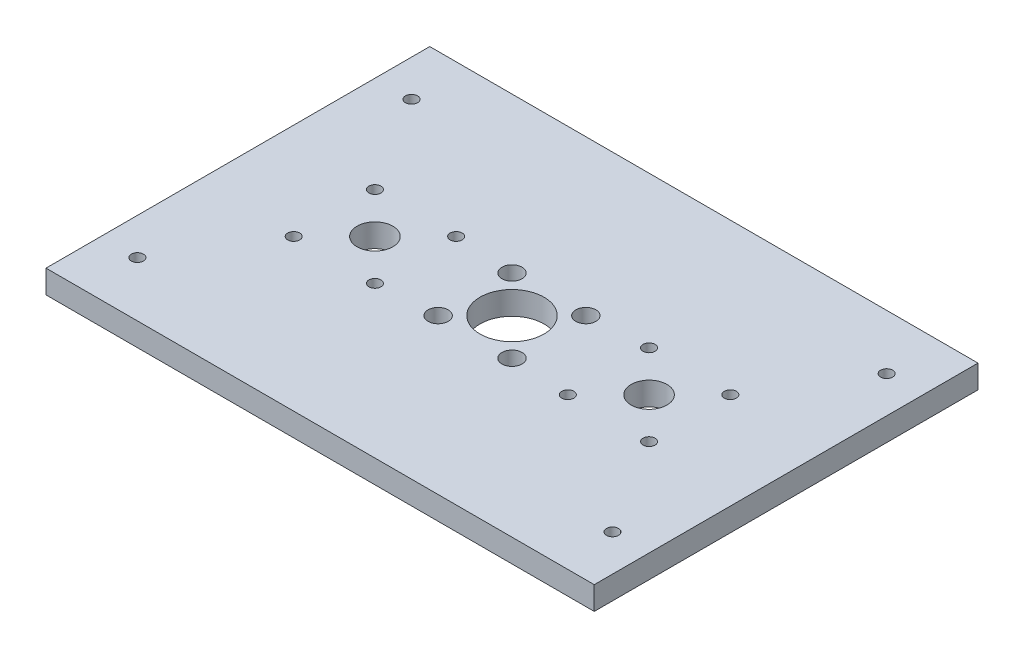
ISO-10303-21;
HEADER;
FILE_DESCRIPTION(('STEP AP214'),'2;1');
FILE_NAME('part.step','',(''),(''),'','','');
FILE_SCHEMA(('AUTOMOTIVE_DESIGN { 1 0 10303 214 1 1 1 1 }'));
ENDSEC;
DATA;
#1=APPLICATION_CONTEXT('core data for automotive mechanical design processes');
#2=APPLICATION_PROTOCOL_DEFINITION('international standard','automotive_design',2000,#1);
#3=PRODUCT_CONTEXT('',#1,'mechanical');
#4=PRODUCT('Part','Part','',(#3));
#5=PRODUCT_RELATED_PRODUCT_CATEGORY('part','',(#4));
#6=PRODUCT_DEFINITION_FORMATION('','',#4);
#7=PRODUCT_DEFINITION_CONTEXT('part definition',#1,'design');
#8=PRODUCT_DEFINITION('design','',#6,#7);
#9=PRODUCT_DEFINITION_SHAPE('','',#8);
#10=(LENGTH_UNIT() NAMED_UNIT(*) SI_UNIT(.MILLI.,.METRE.));
#11=(NAMED_UNIT(*) PLANE_ANGLE_UNIT() SI_UNIT($,.RADIAN.));
#12=(NAMED_UNIT(*) SI_UNIT($,.STERADIAN.) SOLID_ANGLE_UNIT());
#13=UNCERTAINTY_MEASURE_WITH_UNIT(LENGTH_MEASURE(1.E-05),#10,'distance_accuracy_value','');
#14=(GEOMETRIC_REPRESENTATION_CONTEXT(3) GLOBAL_UNCERTAINTY_ASSIGNED_CONTEXT((#13)) GLOBAL_UNIT_ASSIGNED_CONTEXT((#10,
#11,#12)) REPRESENTATION_CONTEXT('',''));
#15=CARTESIAN_POINT('',(0.,0.,0.));
#16=DIRECTION('',(0.,0.,1.));
#17=DIRECTION('',(1.,0.,0.));
#18=AXIS2_PLACEMENT_3D('',#15,#16,#17);
#19=CARTESIAN_POINT('',(0.,6.35,0.));
#20=DIRECTION('',(0.,-1.,0.));
#21=DIRECTION('',(0.,0.,-1.));
#22=AXIS2_PLACEMENT_3D('',#19,#20,#21);
#23=PLANE('',#22);
#24=CARTESIAN_POINT('',(65.,6.35,-37.5));
#25=DIRECTION('',(0.,1.,0.));
#26=DIRECTION('',(0.,0.,-1.));
#27=AXIS2_PLACEMENT_3D('',#24,#25,#26);
#28=CIRCLE('',#27,1.65);
#29=CARTESIAN_POINT('',(65.,6.35,-39.15));
#30=VERTEX_POINT('',#29);
#31=EDGE_CURVE('E217',#30,#30,#28,.T.);
#32=ORIENTED_EDGE('',*,*,#31,.F.);
#33=EDGE_LOOP('',(#32));
#34=FACE_BOUND('',#33,.T.);
#35=CARTESIAN_POINT('',(65.,6.35,37.5));
#36=DIRECTION('',(0.,1.,0.));
#37=DIRECTION('',(0.,0.,-1.));
#38=AXIS2_PLACEMENT_3D('',#35,#36,#37);
#39=CIRCLE('',#38,1.65);
#40=CARTESIAN_POINT('',(65.,6.35,35.85));
#41=VERTEX_POINT('',#40);
#42=EDGE_CURVE('E223',#41,#41,#39,.T.);
#43=ORIENTED_EDGE('',*,*,#42,.F.);
#44=EDGE_LOOP('',(#43));
#45=FACE_BOUND('',#44,.T.);
#46=CARTESIAN_POINT('',(-65.,6.35,37.5));
#47=DIRECTION('',(0.,1.,0.));
#48=DIRECTION('',(0.,0.,1.));
#49=AXIS2_PLACEMENT_3D('',#46,#47,#48);
#50=CIRCLE('',#49,1.65);
#51=CARTESIAN_POINT('',(-65.,6.35,39.15));
#52=VERTEX_POINT('',#51);
#53=EDGE_CURVE('E211',#52,#52,#50,.T.);
#54=ORIENTED_EDGE('',*,*,#53,.F.);
#55=EDGE_LOOP('',(#54));
#56=FACE_BOUND('',#55,.T.);
#57=CARTESIAN_POINT('',(-65.,6.35,-37.5));
#58=DIRECTION('',(0.,1.,0.));
#59=DIRECTION('',(0.,0.,1.));
#60=AXIS2_PLACEMENT_3D('',#57,#58,#59);
#61=CIRCLE('',#60,1.65);
#62=CARTESIAN_POINT('',(-65.,6.35,-35.85));
#63=VERTEX_POINT('',#62);
#64=EDGE_CURVE('E208',#63,#63,#61,.T.);
#65=ORIENTED_EDGE('',*,*,#64,.F.);
#66=EDGE_LOOP('',(#65));
#67=FACE_BOUND('',#66,.T.);
#68=CARTESIAN_POINT('',(37.5000000000002,6.35,0.));
#69=DIRECTION('',(0.,1.,0.));
#70=DIRECTION('',(0.,0.,1.));
#71=AXIS2_PLACEMENT_3D('',#68,#69,#70);
#72=CIRCLE('',#71,4.9);
#73=CARTESIAN_POINT('',(37.5000000000002,6.35,4.89999999999999));
#74=VERTEX_POINT('',#73);
#75=EDGE_CURVE('E151',#74,#74,#72,.T.);
#76=ORIENTED_EDGE('',*,*,#75,.F.);
#77=EDGE_LOOP('',(#76));
#78=FACE_BOUND('',#77,.T.);
#79=CARTESIAN_POINT('',(48.6125000000002,6.35,11.1125));
#80=DIRECTION('',(0.,1.,0.));
#81=DIRECTION('',(0.,0.,1.));
#82=AXIS2_PLACEMENT_3D('',#79,#80,#81);
#83=CIRCLE('',#82,1.65);
#84=CARTESIAN_POINT('',(48.6125000000002,6.35,12.7625));
#85=VERTEX_POINT('',#84);
#86=EDGE_CURVE('E194',#85,#85,#83,.T.);
#87=ORIENTED_EDGE('',*,*,#86,.F.);
#88=EDGE_LOOP('',(#87));
#89=FACE_BOUND('',#88,.T.);
#90=CARTESIAN_POINT('',(26.3875000000002,6.35,11.1125));
#91=DIRECTION('',(0.,1.,0.));
#92=DIRECTION('',(0.,0.,1.));
#93=AXIS2_PLACEMENT_3D('',#90,#91,#92);
#94=CIRCLE('',#93,1.65);
#95=CARTESIAN_POINT('',(26.3875000000002,6.35,12.7625));
#96=VERTEX_POINT('',#95);
#97=EDGE_CURVE('E188',#96,#96,#94,.T.);
#98=ORIENTED_EDGE('',*,*,#97,.F.);
#99=EDGE_LOOP('',(#98));
#100=FACE_BOUND('',#99,.T.);
#101=CARTESIAN_POINT('',(26.3875000000002,6.35,-11.1125));
#102=DIRECTION('',(0.,1.,0.));
#103=DIRECTION('',(0.,0.,1.));
#104=AXIS2_PLACEMENT_3D('',#101,#102,#103);
#105=CIRCLE('',#104,1.65);
#106=CARTESIAN_POINT('',(26.3875000000002,6.35,-9.46250000000001));
#107=VERTEX_POINT('',#106);
#108=EDGE_CURVE('E182',#107,#107,#105,.T.);
#109=ORIENTED_EDGE('',*,*,#108,.F.);
#110=EDGE_LOOP('',(#109));
#111=FACE_BOUND('',#110,.T.);
#112=CARTESIAN_POINT('',(-26.3875000000002,6.35,11.1125));
#113=DIRECTION('',(0.,1.,0.));
#114=DIRECTION('',(0.,0.,-1.));
#115=AXIS2_PLACEMENT_3D('',#112,#113,#114);
#116=CIRCLE('',#115,1.65);
#117=CARTESIAN_POINT('',(-26.3875000000002,6.35,9.4625));
#118=VERTEX_POINT('',#117);
#119=EDGE_CURVE('E176',#118,#118,#116,.T.);
#120=ORIENTED_EDGE('',*,*,#119,.F.);
#121=EDGE_LOOP('',(#120));
#122=FACE_BOUND('',#121,.T.);
#123=CARTESIAN_POINT('',(-48.6125000000002,6.35,11.1125));
#124=DIRECTION('',(0.,1.,0.));
#125=DIRECTION('',(0.,0.,-1.));
#126=AXIS2_PLACEMENT_3D('',#123,#124,#125);
#127=CIRCLE('',#126,1.65);
#128=CARTESIAN_POINT('',(-48.6125000000002,6.35,9.46250000000001));
#129=VERTEX_POINT('',#128);
#130=EDGE_CURVE('E170',#129,#129,#127,.T.);
#131=ORIENTED_EDGE('',*,*,#130,.F.);
#132=EDGE_LOOP('',(#131));
#133=FACE_BOUND('',#132,.T.);
#134=CARTESIAN_POINT('',(-48.6125000000002,6.35,-11.1125));
#135=DIRECTION('',(0.,1.,0.));
#136=DIRECTION('',(0.,0.,-1.));
#137=AXIS2_PLACEMENT_3D('',#134,#135,#136);
#138=CIRCLE('',#137,1.65);
#139=CARTESIAN_POINT('',(-48.6125000000002,6.35,-12.7625));
#140=VERTEX_POINT('',#139);
#141=EDGE_CURVE('E164',#140,#140,#138,.T.);
#142=ORIENTED_EDGE('',*,*,#141,.F.);
#143=EDGE_LOOP('',(#142));
#144=FACE_BOUND('',#143,.T.);
#145=CARTESIAN_POINT('',(-26.3875000000002,6.35,-11.1125));
#146=DIRECTION('',(0.,1.,0.));
#147=DIRECTION('',(0.,0.,-1.));
#148=AXIS2_PLACEMENT_3D('',#145,#146,#147);
#149=CIRCLE('',#148,1.65);
#150=CARTESIAN_POINT('',(-26.3875000000002,6.35,-12.7625));
#151=VERTEX_POINT('',#150);
#152=EDGE_CURVE('E157',#151,#151,#149,.T.);
#153=ORIENTED_EDGE('',*,*,#152,.F.);
#154=EDGE_LOOP('',(#153));
#155=FACE_BOUND('',#154,.T.);
#156=CARTESIAN_POINT('',(-37.4999999999998,6.35,0.));
#157=DIRECTION('',(0.,1.,0.));
#158=DIRECTION('',(0.,0.,-1.));
#159=AXIS2_PLACEMENT_3D('',#156,#157,#158);
#160=CIRCLE('',#159,4.9);
#161=CARTESIAN_POINT('',(-37.4999999999998,6.35,-4.89999999999999));
#162=VERTEX_POINT('',#161);
#163=EDGE_CURVE('E158',#162,#162,#160,.T.);
#164=ORIENTED_EDGE('',*,*,#163,.F.);
#165=EDGE_LOOP('',(#164));
#166=FACE_BOUND('',#165,.T.);
#167=CARTESIAN_POINT('',(48.6125000000002,6.35,-11.1125));
#168=DIRECTION('',(0.,1.,0.));
#169=DIRECTION('',(0.,0.,1.));
#170=AXIS2_PLACEMENT_3D('',#167,#168,#169);
#171=CIRCLE('',#170,1.65);
#172=CARTESIAN_POINT('',(48.6125000000002,6.35,-9.4625));
#173=VERTEX_POINT('',#172);
#174=EDGE_CURVE('E148',#173,#173,#171,.T.);
#175=ORIENTED_EDGE('',*,*,#174,.F.);
#176=EDGE_LOOP('',(#175));
#177=FACE_BOUND('',#176,.T.);
#178=DIRECTION('',(0.,0.,1.));
#179=VECTOR('',#178,1.);
#180=CARTESIAN_POINT('',(-75.,6.35,-52.5));
#181=LINE('',#180,#179);
#182=CARTESIAN_POINT('',(-75.,6.35,-52.5));
#183=VERTEX_POINT('',#182);
#184=CARTESIAN_POINT('',(-75.,6.35,52.5));
#185=VERTEX_POINT('',#184);
#186=EDGE_CURVE('E91',#183,#185,#181,.T.);
#187=ORIENTED_EDGE('',*,*,#186,.T.);
#188=DIRECTION('',(1.,0.,0.));
#189=VECTOR('',#188,1.);
#190=CARTESIAN_POINT('',(75.,6.35,52.5));
#191=LINE('',#190,#189);
#192=CARTESIAN_POINT('',(75.,6.35,52.5));
#193=VERTEX_POINT('',#192);
#194=EDGE_CURVE('E86',#185,#193,#191,.T.);
#195=ORIENTED_EDGE('',*,*,#194,.T.);
#196=DIRECTION('',(0.,0.,-1.));
#197=VECTOR('',#196,1.);
#198=CARTESIAN_POINT('',(75.,6.35,-52.5));
#199=LINE('',#198,#197);
#200=CARTESIAN_POINT('',(75.,6.35,-52.5));
#201=VERTEX_POINT('',#200);
#202=EDGE_CURVE('E89',#193,#201,#199,.T.);
#203=ORIENTED_EDGE('',*,*,#202,.T.);
#204=DIRECTION('',(-1.,0.,0.));
#205=VECTOR('',#204,1.);
#206=CARTESIAN_POINT('',(75.,6.35,-52.5));
#207=LINE('',#206,#205);
#208=EDGE_CURVE('E56',#201,#183,#207,.T.);
#209=ORIENTED_EDGE('',*,*,#208,.T.);
#210=EDGE_LOOP('',(#187,#195,#203,#209));
#211=FACE_BOUND('',#210,.T.);
#212=CARTESIAN_POINT('',(4.44089209850063E-13,6.35,4.44089209850063E-13));
#213=DIRECTION('',(0.,1.,0.));
#214=DIRECTION('',(0.,0.,1.));
#215=AXIS2_PLACEMENT_3D('',#212,#213,#214);
#216=CIRCLE('',#215,8.75000000000001);
#217=CARTESIAN_POINT('',(4.44089209850063E-13,6.35,8.75000000000045));
#218=VERTEX_POINT('',#217);
#219=EDGE_CURVE('E106',#218,#218,#216,.T.);
#220=ORIENTED_EDGE('',*,*,#219,.F.);
#221=EDGE_LOOP('',(#220));
#222=FACE_BOUND('',#221,.T.);
#223=CARTESIAN_POINT('',(10.1027881362028,6.35,10.1027881362028));
#224=DIRECTION('',(0.,1.,0.));
#225=DIRECTION('',(0.,0.,1.));
#226=AXIS2_PLACEMENT_3D('',#223,#224,#225);
#227=CIRCLE('',#226,2.75);
#228=CARTESIAN_POINT('',(10.1027881362028,6.35,12.8527881362028));
#229=VERTEX_POINT('',#228);
#230=EDGE_CURVE('E121',#229,#229,#227,.T.);
#231=ORIENTED_EDGE('',*,*,#230,.F.);
#232=EDGE_LOOP('',(#231));
#233=FACE_BOUND('',#232,.T.);
#234=CARTESIAN_POINT('',(10.1027881362028,6.35,-10.1027881362028));
#235=DIRECTION('',(0.,1.,0.));
#236=DIRECTION('',(0.,0.,1.));
#237=AXIS2_PLACEMENT_3D('',#234,#235,#236);
#238=CIRCLE('',#237,2.75);
#239=CARTESIAN_POINT('',(10.1027881362028,6.35,-7.3527881362028));
#240=VERTEX_POINT('',#239);
#241=EDGE_CURVE('E127',#240,#240,#238,.T.);
#242=ORIENTED_EDGE('',*,*,#241,.F.);
#243=EDGE_LOOP('',(#242));
#244=FACE_BOUND('',#243,.T.);
#245=CARTESIAN_POINT('',(-10.1027881362028,6.35,10.1027881362028));
#246=DIRECTION('',(0.,1.,0.));
#247=DIRECTION('',(0.,0.,1.));
#248=AXIS2_PLACEMENT_3D('',#245,#246,#247);
#249=CIRCLE('',#248,2.75);
#250=CARTESIAN_POINT('',(-10.1027881362028,6.35,12.8527881362028));
#251=VERTEX_POINT('',#250);
#252=EDGE_CURVE('E133',#251,#251,#249,.T.);
#253=ORIENTED_EDGE('',*,*,#252,.F.);
#254=EDGE_LOOP('',(#253));
#255=FACE_BOUND('',#254,.T.);
#256=CARTESIAN_POINT('',(-10.1027881362028,6.35,-10.1027881362028));
#257=DIRECTION('',(0.,1.,0.));
#258=DIRECTION('',(0.,0.,1.));
#259=AXIS2_PLACEMENT_3D('',#256,#257,#258);
#260=CIRCLE('',#259,2.75);
#261=CARTESIAN_POINT('',(-10.1027881362028,6.35,-7.3527881362028));
#262=VERTEX_POINT('',#261);
#263=EDGE_CURVE('E139',#262,#262,#260,.T.);
#264=ORIENTED_EDGE('',*,*,#263,.F.);
#265=EDGE_LOOP('',(#264));
#266=FACE_BOUND('',#265,.T.);
#267=ADVANCED_FACE('F39',(#34,#45,#56,#67,#78,#89,#100,#111,#122,#133,#144,#155,#166,#177,#211,
#222,#233,#244,#255,#266),#23,.F.);
#268=CARTESIAN_POINT('',(0.,0.,0.));
#269=DIRECTION('',(0.,-1.,0.));
#270=DIRECTION('',(0.,0.,-1.));
#271=AXIS2_PLACEMENT_3D('',#268,#269,#270);
#272=PLANE('',#271);
#273=CARTESIAN_POINT('',(65.,0.,-37.5));
#274=DIRECTION('',(0.,1.,0.));
#275=DIRECTION('',(0.,0.,-1.));
#276=AXIS2_PLACEMENT_3D('',#273,#274,#275);
#277=CIRCLE('',#276,1.65);
#278=CARTESIAN_POINT('',(65.,0.,-39.15));
#279=VERTEX_POINT('',#278);
#280=EDGE_CURVE('E214',#279,#279,#277,.T.);
#281=ORIENTED_EDGE('',*,*,#280,.T.);
#282=EDGE_LOOP('',(#281));
#283=FACE_BOUND('',#282,.T.);
#284=CARTESIAN_POINT('',(65.,0.,37.5));
#285=DIRECTION('',(0.,1.,0.));
#286=DIRECTION('',(0.,0.,-1.));
#287=AXIS2_PLACEMENT_3D('',#284,#285,#286);
#288=CIRCLE('',#287,1.65);
#289=CARTESIAN_POINT('',(65.,0.,35.85));
#290=VERTEX_POINT('',#289);
#291=EDGE_CURVE('E220',#290,#290,#288,.T.);
#292=ORIENTED_EDGE('',*,*,#291,.T.);
#293=EDGE_LOOP('',(#292));
#294=FACE_BOUND('',#293,.T.);
#295=CARTESIAN_POINT('',(-65.,0.,37.5));
#296=DIRECTION('',(0.,1.,0.));
#297=DIRECTION('',(0.,0.,1.));
#298=AXIS2_PLACEMENT_3D('',#295,#296,#297);
#299=CIRCLE('',#298,1.65);
#300=CARTESIAN_POINT('',(-65.,0.,39.15));
#301=VERTEX_POINT('',#300);
#302=EDGE_CURVE('E226',#301,#301,#299,.T.);
#303=ORIENTED_EDGE('',*,*,#302,.T.);
#304=EDGE_LOOP('',(#303));
#305=FACE_BOUND('',#304,.T.);
#306=CARTESIAN_POINT('',(-65.,0.,-37.5));
#307=DIRECTION('',(0.,1.,0.));
#308=DIRECTION('',(0.,0.,1.));
#309=AXIS2_PLACEMENT_3D('',#306,#307,#308);
#310=CIRCLE('',#309,1.65);
#311=CARTESIAN_POINT('',(-65.,0.,-35.85));
#312=VERTEX_POINT('',#311);
#313=EDGE_CURVE('E205',#312,#312,#310,.T.);
#314=ORIENTED_EDGE('',*,*,#313,.T.);
#315=EDGE_LOOP('',(#314));
#316=FACE_BOUND('',#315,.T.);
#317=CARTESIAN_POINT('',(37.5000000000002,0.,0.));
#318=DIRECTION('',(0.,1.,0.));
#319=DIRECTION('',(0.,0.,1.));
#320=AXIS2_PLACEMENT_3D('',#317,#318,#319);
#321=CIRCLE('',#320,4.9);
#322=CARTESIAN_POINT('',(37.5000000000002,0.,4.89999999999999));
#323=VERTEX_POINT('',#322);
#324=EDGE_CURVE('E197',#323,#323,#321,.T.);
#325=ORIENTED_EDGE('',*,*,#324,.T.);
#326=EDGE_LOOP('',(#325));
#327=FACE_BOUND('',#326,.T.);
#328=CARTESIAN_POINT('',(48.6125000000002,0.,11.1125));
#329=DIRECTION('',(0.,1.,0.));
#330=DIRECTION('',(0.,0.,1.));
#331=AXIS2_PLACEMENT_3D('',#328,#329,#330);
#332=CIRCLE('',#331,1.65);
#333=CARTESIAN_POINT('',(48.6125000000002,0.,12.7625));
#334=VERTEX_POINT('',#333);
#335=EDGE_CURVE('E191',#334,#334,#332,.T.);
#336=ORIENTED_EDGE('',*,*,#335,.T.);
#337=EDGE_LOOP('',(#336));
#338=FACE_BOUND('',#337,.T.);
#339=CARTESIAN_POINT('',(26.3875000000002,0.,11.1125));
#340=DIRECTION('',(0.,1.,0.));
#341=DIRECTION('',(0.,0.,1.));
#342=AXIS2_PLACEMENT_3D('',#339,#340,#341);
#343=CIRCLE('',#342,1.65);
#344=CARTESIAN_POINT('',(26.3875000000002,0.,12.7625));
#345=VERTEX_POINT('',#344);
#346=EDGE_CURVE('E185',#345,#345,#343,.T.);
#347=ORIENTED_EDGE('',*,*,#346,.T.);
#348=EDGE_LOOP('',(#347));
#349=FACE_BOUND('',#348,.T.);
#350=CARTESIAN_POINT('',(26.3875000000002,0.,-11.1125));
#351=DIRECTION('',(0.,1.,0.));
#352=DIRECTION('',(0.,0.,1.));
#353=AXIS2_PLACEMENT_3D('',#350,#351,#352);
#354=CIRCLE('',#353,1.65);
#355=CARTESIAN_POINT('',(26.3875000000002,0.,-9.46250000000001));
#356=VERTEX_POINT('',#355);
#357=EDGE_CURVE('E179',#356,#356,#354,.T.);
#358=ORIENTED_EDGE('',*,*,#357,.T.);
#359=EDGE_LOOP('',(#358));
#360=FACE_BOUND('',#359,.T.);
#361=CARTESIAN_POINT('',(-26.3875000000002,0.,11.1125));
#362=DIRECTION('',(0.,1.,0.));
#363=DIRECTION('',(0.,0.,-1.));
#364=AXIS2_PLACEMENT_3D('',#361,#362,#363);
#365=CIRCLE('',#364,1.65);
#366=CARTESIAN_POINT('',(-26.3875000000002,0.,9.4625));
#367=VERTEX_POINT('',#366);
#368=EDGE_CURVE('E173',#367,#367,#365,.T.);
#369=ORIENTED_EDGE('',*,*,#368,.T.);
#370=EDGE_LOOP('',(#369));
#371=FACE_BOUND('',#370,.T.);
#372=CARTESIAN_POINT('',(-48.6125000000002,0.,11.1125));
#373=DIRECTION('',(0.,1.,0.));
#374=DIRECTION('',(0.,0.,-1.));
#375=AXIS2_PLACEMENT_3D('',#372,#373,#374);
#376=CIRCLE('',#375,1.65);
#377=CARTESIAN_POINT('',(-48.6125000000002,0.,9.46250000000001));
#378=VERTEX_POINT('',#377);
#379=EDGE_CURVE('E167',#378,#378,#376,.T.);
#380=ORIENTED_EDGE('',*,*,#379,.T.);
#381=EDGE_LOOP('',(#380));
#382=FACE_BOUND('',#381,.T.);
#383=CARTESIAN_POINT('',(-48.6125000000002,0.,-11.1125));
#384=DIRECTION('',(0.,1.,0.));
#385=DIRECTION('',(0.,0.,-1.));
#386=AXIS2_PLACEMENT_3D('',#383,#384,#385);
#387=CIRCLE('',#386,1.65);
#388=CARTESIAN_POINT('',(-48.6125000000002,0.,-12.7625));
#389=VERTEX_POINT('',#388);
#390=EDGE_CURVE('E161',#389,#389,#387,.T.);
#391=ORIENTED_EDGE('',*,*,#390,.T.);
#392=EDGE_LOOP('',(#391));
#393=FACE_BOUND('',#392,.T.);
#394=CARTESIAN_POINT('',(-26.3875000000002,0.,-11.1125));
#395=DIRECTION('',(0.,1.,0.));
#396=DIRECTION('',(0.,0.,-1.));
#397=AXIS2_PLACEMENT_3D('',#394,#395,#396);
#398=CIRCLE('',#397,1.65);
#399=CARTESIAN_POINT('',(-26.3875000000002,0.,-12.7625));
#400=VERTEX_POINT('',#399);
#401=EDGE_CURVE('E154',#400,#400,#398,.T.);
#402=ORIENTED_EDGE('',*,*,#401,.T.);
#403=EDGE_LOOP('',(#402));
#404=FACE_BOUND('',#403,.T.);
#405=CARTESIAN_POINT('',(-37.4999999999998,0.,0.));
#406=DIRECTION('',(0.,1.,0.));
#407=DIRECTION('',(0.,0.,-1.));
#408=AXIS2_PLACEMENT_3D('',#405,#406,#407);
#409=CIRCLE('',#408,4.9);
#410=CARTESIAN_POINT('',(-37.4999999999998,0.,-4.89999999999999));
#411=VERTEX_POINT('',#410);
#412=EDGE_CURVE('E202',#411,#411,#409,.T.);
#413=ORIENTED_EDGE('',*,*,#412,.T.);
#414=EDGE_LOOP('',(#413));
#415=FACE_BOUND('',#414,.T.);
#416=CARTESIAN_POINT('',(48.6125000000002,0.,-11.1125));
#417=DIRECTION('',(0.,1.,0.));
#418=DIRECTION('',(0.,0.,1.));
#419=AXIS2_PLACEMENT_3D('',#416,#417,#418);
#420=CIRCLE('',#419,1.65);
#421=CARTESIAN_POINT('',(48.6125000000002,0.,-9.4625));
#422=VERTEX_POINT('',#421);
#423=EDGE_CURVE('E145',#422,#422,#420,.T.);
#424=ORIENTED_EDGE('',*,*,#423,.T.);
#425=EDGE_LOOP('',(#424));
#426=FACE_BOUND('',#425,.T.);
#427=CARTESIAN_POINT('',(-10.1027881362028,0.,10.1027881362028));
#428=DIRECTION('',(0.,1.,0.));
#429=DIRECTION('',(0.,0.,1.));
#430=AXIS2_PLACEMENT_3D('',#427,#428,#429);
#431=CIRCLE('',#430,2.75);
#432=CARTESIAN_POINT('',(-10.1027881362028,0.,12.8527881362028));
#433=VERTEX_POINT('',#432);
#434=EDGE_CURVE('E136',#433,#433,#431,.T.);
#435=ORIENTED_EDGE('',*,*,#434,.T.);
#436=EDGE_LOOP('',(#435));
#437=FACE_BOUND('',#436,.T.);
#438=CARTESIAN_POINT('',(10.1027881362028,0.,10.1027881362028));
#439=DIRECTION('',(0.,1.,0.));
#440=DIRECTION('',(0.,0.,1.));
#441=AXIS2_PLACEMENT_3D('',#438,#439,#440);
#442=CIRCLE('',#441,2.75);
#443=CARTESIAN_POINT('',(10.1027881362028,0.,12.8527881362028));
#444=VERTEX_POINT('',#443);
#445=EDGE_CURVE('E124',#444,#444,#442,.T.);
#446=ORIENTED_EDGE('',*,*,#445,.T.);
#447=EDGE_LOOP('',(#446));
#448=FACE_BOUND('',#447,.T.);
#449=DIRECTION('',(0.,0.,1.));
#450=VECTOR('',#449,1.);
#451=CARTESIAN_POINT('',(-75.,0.,-52.5));
#452=LINE('',#451,#450);
#453=CARTESIAN_POINT('',(-75.,0.,-52.5));
#454=VERTEX_POINT('',#453);
#455=CARTESIAN_POINT('',(-75.,0.,52.5));
#456=VERTEX_POINT('',#455);
#457=EDGE_CURVE('E103',#454,#456,#452,.T.);
#458=ORIENTED_EDGE('',*,*,#457,.F.);
#459=DIRECTION('',(-1.,0.,0.));
#460=VECTOR('',#459,1.);
#461=CARTESIAN_POINT('',(75.,0.,-52.5));
#462=LINE('',#461,#460);
#463=CARTESIAN_POINT('',(75.,0.,-52.5));
#464=VERTEX_POINT('',#463);
#465=EDGE_CURVE('E79',#464,#454,#462,.T.);
#466=ORIENTED_EDGE('',*,*,#465,.F.);
#467=DIRECTION('',(0.,0.,-1.));
#468=VECTOR('',#467,1.);
#469=CARTESIAN_POINT('',(75.,0.,-52.5));
#470=LINE('',#469,#468);
#471=CARTESIAN_POINT('',(75.,0.,52.5));
#472=VERTEX_POINT('',#471);
#473=EDGE_CURVE('E73',#472,#464,#470,.T.);
#474=ORIENTED_EDGE('',*,*,#473,.F.);
#475=DIRECTION('',(1.,0.,0.));
#476=VECTOR('',#475,1.);
#477=CARTESIAN_POINT('',(75.,0.,52.5));
#478=LINE('',#477,#476);
#479=EDGE_CURVE('E95',#456,#472,#478,.T.);
#480=ORIENTED_EDGE('',*,*,#479,.F.);
#481=EDGE_LOOP('',(#458,#466,#474,#480));
#482=FACE_BOUND('',#481,.T.);
#483=CARTESIAN_POINT('',(4.44089209850063E-13,0.,4.44089209850063E-13));
#484=DIRECTION('',(0.,1.,0.));
#485=DIRECTION('',(0.,0.,1.));
#486=AXIS2_PLACEMENT_3D('',#483,#484,#485);
#487=CIRCLE('',#486,8.75000000000001);
#488=CARTESIAN_POINT('',(4.44089209850063E-13,0.,8.75000000000045));
#489=VERTEX_POINT('',#488);
#490=EDGE_CURVE('E118',#489,#489,#487,.T.);
#491=ORIENTED_EDGE('',*,*,#490,.T.);
#492=EDGE_LOOP('',(#491));
#493=FACE_BOUND('',#492,.T.);
#494=CARTESIAN_POINT('',(10.1027881362028,0.,-10.1027881362028));
#495=DIRECTION('',(0.,1.,0.));
#496=DIRECTION('',(0.,0.,1.));
#497=AXIS2_PLACEMENT_3D('',#494,#495,#496);
#498=CIRCLE('',#497,2.75);
#499=CARTESIAN_POINT('',(10.1027881362028,0.,-7.3527881362028));
#500=VERTEX_POINT('',#499);
#501=EDGE_CURVE('E130',#500,#500,#498,.T.);
#502=ORIENTED_EDGE('',*,*,#501,.T.);
#503=EDGE_LOOP('',(#502));
#504=FACE_BOUND('',#503,.T.);
#505=CARTESIAN_POINT('',(-10.1027881362028,0.,-10.1027881362028));
#506=DIRECTION('',(0.,1.,0.));
#507=DIRECTION('',(0.,0.,1.));
#508=AXIS2_PLACEMENT_3D('',#505,#506,#507);
#509=CIRCLE('',#508,2.75);
#510=CARTESIAN_POINT('',(-10.1027881362028,0.,-7.3527881362028));
#511=VERTEX_POINT('',#510);
#512=EDGE_CURVE('E142',#511,#511,#509,.T.);
#513=ORIENTED_EDGE('',*,*,#512,.T.);
#514=EDGE_LOOP('',(#513));
#515=FACE_BOUND('',#514,.T.);
#516=ADVANCED_FACE('F114',(#283,#294,#305,#316,#327,#338,#349,#360,#371,#382,#393,#404,#415,
#426,#437,#448,#482,#493,#504,#515),#272,.T.);
#517=CARTESIAN_POINT('',(-75.,6.35,-52.5));
#518=DIRECTION('',(1.,0.,0.));
#519=DIRECTION('',(0.,0.,-1.));
#520=AXIS2_PLACEMENT_3D('',#517,#518,#519);
#521=PLANE('',#520);
#522=ORIENTED_EDGE('',*,*,#457,.T.);
#523=DIRECTION('',(0.,-1.,0.));
#524=VECTOR('',#523,1.);
#525=CARTESIAN_POINT('',(-75.,6.35,52.5));
#526=LINE('',#525,#524);
#527=EDGE_CURVE('E11',#185,#456,#526,.T.);
#528=ORIENTED_EDGE('',*,*,#527,.F.);
#529=ORIENTED_EDGE('',*,*,#186,.F.);
#530=DIRECTION('',(0.,-1.,0.));
#531=VECTOR('',#530,1.);
#532=CARTESIAN_POINT('',(-75.,6.35,-52.5));
#533=LINE('',#532,#531);
#534=EDGE_CURVE('E99',#183,#454,#533,.T.);
#535=ORIENTED_EDGE('',*,*,#534,.T.);
#536=EDGE_LOOP('',(#522,#528,#529,#535));
#537=FACE_BOUND('',#536,.T.);
#538=ADVANCED_FACE('F41',(#537),#521,.F.);
#539=CARTESIAN_POINT('',(75.,6.35,52.5));
#540=DIRECTION('',(0.,0.,-1.));
#541=DIRECTION('',(-1.,0.,0.));
#542=AXIS2_PLACEMENT_3D('',#539,#540,#541);
#543=PLANE('',#542);
#544=ORIENTED_EDGE('',*,*,#479,.T.);
#545=DIRECTION('',(0.,-1.,0.));
#546=VECTOR('',#545,1.);
#547=CARTESIAN_POINT('',(75.,6.35,52.5));
#548=LINE('',#547,#546);
#549=EDGE_CURVE('E48',#193,#472,#548,.T.);
#550=ORIENTED_EDGE('',*,*,#549,.F.);
#551=ORIENTED_EDGE('',*,*,#194,.F.);
#552=ORIENTED_EDGE('',*,*,#527,.T.);
#553=EDGE_LOOP('',(#544,#550,#551,#552));
#554=FACE_BOUND('',#553,.T.);
#555=ADVANCED_FACE('F94',(#554),#543,.F.);
#556=CARTESIAN_POINT('',(75.,6.35,-52.5));
#557=DIRECTION('',(-1.,0.,0.));
#558=DIRECTION('',(0.,0.,1.));
#559=AXIS2_PLACEMENT_3D('',#556,#557,#558);
#560=PLANE('',#559);
#561=ORIENTED_EDGE('',*,*,#473,.T.);
#562=DIRECTION('',(0.,-1.,0.));
#563=VECTOR('',#562,1.);
#564=CARTESIAN_POINT('',(75.,6.35,-52.5));
#565=LINE('',#564,#563);
#566=EDGE_CURVE('E96',#201,#464,#565,.T.);
#567=ORIENTED_EDGE('',*,*,#566,.F.);
#568=ORIENTED_EDGE('',*,*,#202,.F.);
#569=ORIENTED_EDGE('',*,*,#549,.T.);
#570=EDGE_LOOP('',(#561,#567,#568,#569));
#571=FACE_BOUND('',#570,.T.);
#572=ADVANCED_FACE('F97',(#571),#560,.F.);
#573=CARTESIAN_POINT('',(75.,6.35,-52.5));
#574=DIRECTION('',(0.,0.,1.));
#575=DIRECTION('',(1.,0.,0.));
#576=AXIS2_PLACEMENT_3D('',#573,#574,#575);
#577=PLANE('',#576);
#578=ORIENTED_EDGE('',*,*,#465,.T.);
#579=ORIENTED_EDGE('',*,*,#534,.F.);
#580=ORIENTED_EDGE('',*,*,#208,.F.);
#581=ORIENTED_EDGE('',*,*,#566,.T.);
#582=EDGE_LOOP('',(#578,#579,#580,#581));
#583=FACE_BOUND('',#582,.T.);
#584=ADVANCED_FACE('F111',(#583),#577,.F.);
#585=CARTESIAN_POINT('',(4.44089209850063E-13,6.35,4.44089209850063E-13));
#586=DIRECTION('',(0.,-1.,0.));
#587=DIRECTION('',(0.,0.,-1.));
#588=AXIS2_PLACEMENT_3D('',#585,#586,#587);
#589=CYLINDRICAL_SURFACE('',#588,8.75000000000001);
#590=ORIENTED_EDGE('',*,*,#219,.T.);
#591=EDGE_LOOP('',(#590));
#592=FACE_BOUND('',#591,.T.);
#593=ORIENTED_EDGE('',*,*,#490,.F.);
#594=EDGE_LOOP('',(#593));
#595=FACE_BOUND('',#594,.T.);
#596=ADVANCED_FACE('F290',(#592,#595),#589,.F.);
#597=CARTESIAN_POINT('',(10.1027881362028,6.35,10.1027881362028));
#598=DIRECTION('',(0.,-1.,0.));
#599=DIRECTION('',(0.,0.,-1.));
#600=AXIS2_PLACEMENT_3D('',#597,#598,#599);
#601=CYLINDRICAL_SURFACE('',#600,2.75);
#602=ORIENTED_EDGE('',*,*,#230,.T.);
#603=EDGE_LOOP('',(#602));
#604=FACE_BOUND('',#603,.T.);
#605=ORIENTED_EDGE('',*,*,#445,.F.);
#606=EDGE_LOOP('',(#605));
#607=FACE_BOUND('',#606,.T.);
#608=ADVANCED_FACE('F286',(#604,#607),#601,.F.);
#609=CARTESIAN_POINT('',(10.1027881362028,6.35,-10.1027881362028));
#610=DIRECTION('',(0.,-1.,0.));
#611=DIRECTION('',(0.,0.,-1.));
#612=AXIS2_PLACEMENT_3D('',#609,#610,#611);
#613=CYLINDRICAL_SURFACE('',#612,2.75);
#614=ORIENTED_EDGE('',*,*,#241,.T.);
#615=EDGE_LOOP('',(#614));
#616=FACE_BOUND('',#615,.T.);
#617=ORIENTED_EDGE('',*,*,#501,.F.);
#618=EDGE_LOOP('',(#617));
#619=FACE_BOUND('',#618,.T.);
#620=ADVANCED_FACE('F282',(#616,#619),#613,.F.);
#621=CARTESIAN_POINT('',(-10.1027881362028,6.35,10.1027881362028));
#622=DIRECTION('',(0.,-1.,0.));
#623=DIRECTION('',(0.,0.,-1.));
#624=AXIS2_PLACEMENT_3D('',#621,#622,#623);
#625=CYLINDRICAL_SURFACE('',#624,2.75);
#626=ORIENTED_EDGE('',*,*,#252,.T.);
#627=EDGE_LOOP('',(#626));
#628=FACE_BOUND('',#627,.T.);
#629=ORIENTED_EDGE('',*,*,#434,.F.);
#630=EDGE_LOOP('',(#629));
#631=FACE_BOUND('',#630,.T.);
#632=ADVANCED_FACE('F273',(#628,#631),#625,.F.);
#633=CARTESIAN_POINT('',(-10.1027881362028,6.35,-10.1027881362028));
#634=DIRECTION('',(0.,-1.,0.));
#635=DIRECTION('',(0.,0.,-1.));
#636=AXIS2_PLACEMENT_3D('',#633,#634,#635);
#637=CYLINDRICAL_SURFACE('',#636,2.75);
#638=ORIENTED_EDGE('',*,*,#263,.T.);
#639=EDGE_LOOP('',(#638));
#640=FACE_BOUND('',#639,.T.);
#641=ORIENTED_EDGE('',*,*,#512,.F.);
#642=EDGE_LOOP('',(#641));
#643=FACE_BOUND('',#642,.T.);
#644=ADVANCED_FACE('F263',(#640,#643),#637,.F.);
#645=CARTESIAN_POINT('',(48.6125000000002,0.,-11.1125));
#646=DIRECTION('',(0.,1.,0.));
#647=DIRECTION('',(0.,0.,1.));
#648=AXIS2_PLACEMENT_3D('',#645,#646,#647);
#649=CYLINDRICAL_SURFACE('',#648,1.65);
#650=ORIENTED_EDGE('',*,*,#423,.F.);
#651=EDGE_LOOP('',(#650));
#652=FACE_BOUND('',#651,.T.);
#653=ORIENTED_EDGE('',*,*,#174,.T.);
#654=EDGE_LOOP('',(#653));
#655=FACE_BOUND('',#654,.T.);
#656=ADVANCED_FACE('F260',(#652,#655),#649,.F.);
#657=CARTESIAN_POINT('',(-37.4999999999998,0.,0.));
#658=DIRECTION('',(0.,1.,0.));
#659=DIRECTION('',(0.,0.,1.));
#660=AXIS2_PLACEMENT_3D('',#657,#658,#659);
#661=CYLINDRICAL_SURFACE('',#660,4.9);
#662=ORIENTED_EDGE('',*,*,#412,.F.);
#663=EDGE_LOOP('',(#662));
#664=FACE_BOUND('',#663,.T.);
#665=ORIENTED_EDGE('',*,*,#163,.T.);
#666=EDGE_LOOP('',(#665));
#667=FACE_BOUND('',#666,.T.);
#668=ADVANCED_FACE('F262',(#664,#667),#661,.F.);
#669=CARTESIAN_POINT('',(-26.3875000000002,0.,-11.1125));
#670=DIRECTION('',(0.,1.,0.));
#671=DIRECTION('',(0.,0.,1.));
#672=AXIS2_PLACEMENT_3D('',#669,#670,#671);
#673=CYLINDRICAL_SURFACE('',#672,1.65);
#674=ORIENTED_EDGE('',*,*,#401,.F.);
#675=EDGE_LOOP('',(#674));
#676=FACE_BOUND('',#675,.T.);
#677=ORIENTED_EDGE('',*,*,#152,.T.);
#678=EDGE_LOOP('',(#677));
#679=FACE_BOUND('',#678,.T.);
#680=ADVANCED_FACE('F270',(#676,#679),#673,.F.);
#681=CARTESIAN_POINT('',(-48.6125000000002,0.,-11.1125));
#682=DIRECTION('',(0.,1.,0.));
#683=DIRECTION('',(0.,0.,1.));
#684=AXIS2_PLACEMENT_3D('',#681,#682,#683);
#685=CYLINDRICAL_SURFACE('',#684,1.65);
#686=ORIENTED_EDGE('',*,*,#390,.F.);
#687=EDGE_LOOP('',(#686));
#688=FACE_BOUND('',#687,.T.);
#689=ORIENTED_EDGE('',*,*,#141,.T.);
#690=EDGE_LOOP('',(#689));
#691=FACE_BOUND('',#690,.T.);
#692=ADVANCED_FACE('F378',(#688,#691),#685,.F.);
#693=CARTESIAN_POINT('',(-48.6125000000002,0.,11.1125));
#694=DIRECTION('',(0.,1.,0.));
#695=DIRECTION('',(0.,0.,1.));
#696=AXIS2_PLACEMENT_3D('',#693,#694,#695);
#697=CYLINDRICAL_SURFACE('',#696,1.65);
#698=ORIENTED_EDGE('',*,*,#379,.F.);
#699=EDGE_LOOP('',(#698));
#700=FACE_BOUND('',#699,.T.);
#701=ORIENTED_EDGE('',*,*,#130,.T.);
#702=EDGE_LOOP('',(#701));
#703=FACE_BOUND('',#702,.T.);
#704=ADVANCED_FACE('F387',(#700,#703),#697,.F.);
#705=CARTESIAN_POINT('',(-26.3875000000002,0.,11.1125));
#706=DIRECTION('',(0.,1.,0.));
#707=DIRECTION('',(0.,0.,1.));
#708=AXIS2_PLACEMENT_3D('',#705,#706,#707);
#709=CYLINDRICAL_SURFACE('',#708,1.65);
#710=ORIENTED_EDGE('',*,*,#368,.F.);
#711=EDGE_LOOP('',(#710));
#712=FACE_BOUND('',#711,.T.);
#713=ORIENTED_EDGE('',*,*,#119,.T.);
#714=EDGE_LOOP('',(#713));
#715=FACE_BOUND('',#714,.T.);
#716=ADVANCED_FACE('F396',(#712,#715),#709,.F.);
#717=CARTESIAN_POINT('',(26.3875000000002,0.,-11.1125));
#718=DIRECTION('',(0.,1.,0.));
#719=DIRECTION('',(0.,0.,1.));
#720=AXIS2_PLACEMENT_3D('',#717,#718,#719);
#721=CYLINDRICAL_SURFACE('',#720,1.65);
#722=ORIENTED_EDGE('',*,*,#357,.F.);
#723=EDGE_LOOP('',(#722));
#724=FACE_BOUND('',#723,.T.);
#725=ORIENTED_EDGE('',*,*,#108,.T.);
#726=EDGE_LOOP('',(#725));
#727=FACE_BOUND('',#726,.T.);
#728=ADVANCED_FACE('F406',(#724,#727),#721,.F.);
#729=CARTESIAN_POINT('',(26.3875000000002,0.,11.1125));
#730=DIRECTION('',(0.,1.,0.));
#731=DIRECTION('',(0.,0.,1.));
#732=AXIS2_PLACEMENT_3D('',#729,#730,#731);
#733=CYLINDRICAL_SURFACE('',#732,1.65);
#734=ORIENTED_EDGE('',*,*,#346,.F.);
#735=EDGE_LOOP('',(#734));
#736=FACE_BOUND('',#735,.T.);
#737=ORIENTED_EDGE('',*,*,#97,.T.);
#738=EDGE_LOOP('',(#737));
#739=FACE_BOUND('',#738,.T.);
#740=ADVANCED_FACE('F416',(#736,#739),#733,.F.);
#741=CARTESIAN_POINT('',(48.6125000000002,0.,11.1125));
#742=DIRECTION('',(0.,1.,0.));
#743=DIRECTION('',(0.,0.,1.));
#744=AXIS2_PLACEMENT_3D('',#741,#742,#743);
#745=CYLINDRICAL_SURFACE('',#744,1.65);
#746=ORIENTED_EDGE('',*,*,#335,.F.);
#747=EDGE_LOOP('',(#746));
#748=FACE_BOUND('',#747,.T.);
#749=ORIENTED_EDGE('',*,*,#86,.T.);
#750=EDGE_LOOP('',(#749));
#751=FACE_BOUND('',#750,.T.);
#752=ADVANCED_FACE('F426',(#748,#751),#745,.F.);
#753=CARTESIAN_POINT('',(37.5000000000002,0.,0.));
#754=DIRECTION('',(0.,1.,0.));
#755=DIRECTION('',(0.,0.,1.));
#756=AXIS2_PLACEMENT_3D('',#753,#754,#755);
#757=CYLINDRICAL_SURFACE('',#756,4.9);
#758=ORIENTED_EDGE('',*,*,#324,.F.);
#759=EDGE_LOOP('',(#758));
#760=FACE_BOUND('',#759,.T.);
#761=ORIENTED_EDGE('',*,*,#75,.T.);
#762=EDGE_LOOP('',(#761));
#763=FACE_BOUND('',#762,.T.);
#764=ADVANCED_FACE('F436',(#760,#763),#757,.F.);
#765=CARTESIAN_POINT('',(-65.,0.,-37.5));
#766=DIRECTION('',(0.,1.,0.));
#767=DIRECTION('',(0.,0.,1.));
#768=AXIS2_PLACEMENT_3D('',#765,#766,#767);
#769=CYLINDRICAL_SURFACE('',#768,1.65);
#770=ORIENTED_EDGE('',*,*,#313,.F.);
#771=EDGE_LOOP('',(#770));
#772=FACE_BOUND('',#771,.T.);
#773=ORIENTED_EDGE('',*,*,#64,.T.);
#774=EDGE_LOOP('',(#773));
#775=FACE_BOUND('',#774,.T.);
#776=ADVANCED_FACE('F446',(#772,#775),#769,.F.);
#777=CARTESIAN_POINT('',(-65.,0.,37.5));
#778=DIRECTION('',(0.,1.,0.));
#779=DIRECTION('',(0.,0.,1.));
#780=AXIS2_PLACEMENT_3D('',#777,#778,#779);
#781=CYLINDRICAL_SURFACE('',#780,1.65);
#782=ORIENTED_EDGE('',*,*,#302,.F.);
#783=EDGE_LOOP('',(#782));
#784=FACE_BOUND('',#783,.T.);
#785=ORIENTED_EDGE('',*,*,#53,.T.);
#786=EDGE_LOOP('',(#785));
#787=FACE_BOUND('',#786,.T.);
#788=ADVANCED_FACE('F232',(#784,#787),#781,.F.);
#789=CARTESIAN_POINT('',(65.,0.,37.5));
#790=DIRECTION('',(0.,1.,0.));
#791=DIRECTION('',(0.,0.,1.));
#792=AXIS2_PLACEMENT_3D('',#789,#790,#791);
#793=CYLINDRICAL_SURFACE('',#792,1.65);
#794=ORIENTED_EDGE('',*,*,#291,.F.);
#795=EDGE_LOOP('',(#794));
#796=FACE_BOUND('',#795,.T.);
#797=ORIENTED_EDGE('',*,*,#42,.T.);
#798=EDGE_LOOP('',(#797));
#799=FACE_BOUND('',#798,.T.);
#800=ADVANCED_FACE('F465',(#796,#799),#793,.F.);
#801=CARTESIAN_POINT('',(65.,0.,-37.5));
#802=DIRECTION('',(0.,1.,0.));
#803=DIRECTION('',(0.,0.,1.));
#804=AXIS2_PLACEMENT_3D('',#801,#802,#803);
#805=CYLINDRICAL_SURFACE('',#804,1.65);
#806=ORIENTED_EDGE('',*,*,#280,.F.);
#807=EDGE_LOOP('',(#806));
#808=FACE_BOUND('',#807,.T.);
#809=ORIENTED_EDGE('',*,*,#31,.T.);
#810=EDGE_LOOP('',(#809));
#811=FACE_BOUND('',#810,.T.);
#812=ADVANCED_FACE('F475',(#808,#811),#805,.F.);
#813=CLOSED_SHELL('',(#267,#516,#538,#555,#572,#584,#596,#608,#620,#632,#644,#656,#668,#680,
#692,#704,#716,#728,#740,#752,#764,#776,#788,#800,#812));
#814=MANIFOLD_SOLID_BREP('B2',#813);
#815=ADVANCED_BREP_SHAPE_REPRESENTATION('',(#18,#814),#14);
#816=SHAPE_DEFINITION_REPRESENTATION(#9,#815);
ENDSEC;
END-ISO-10303-21;
